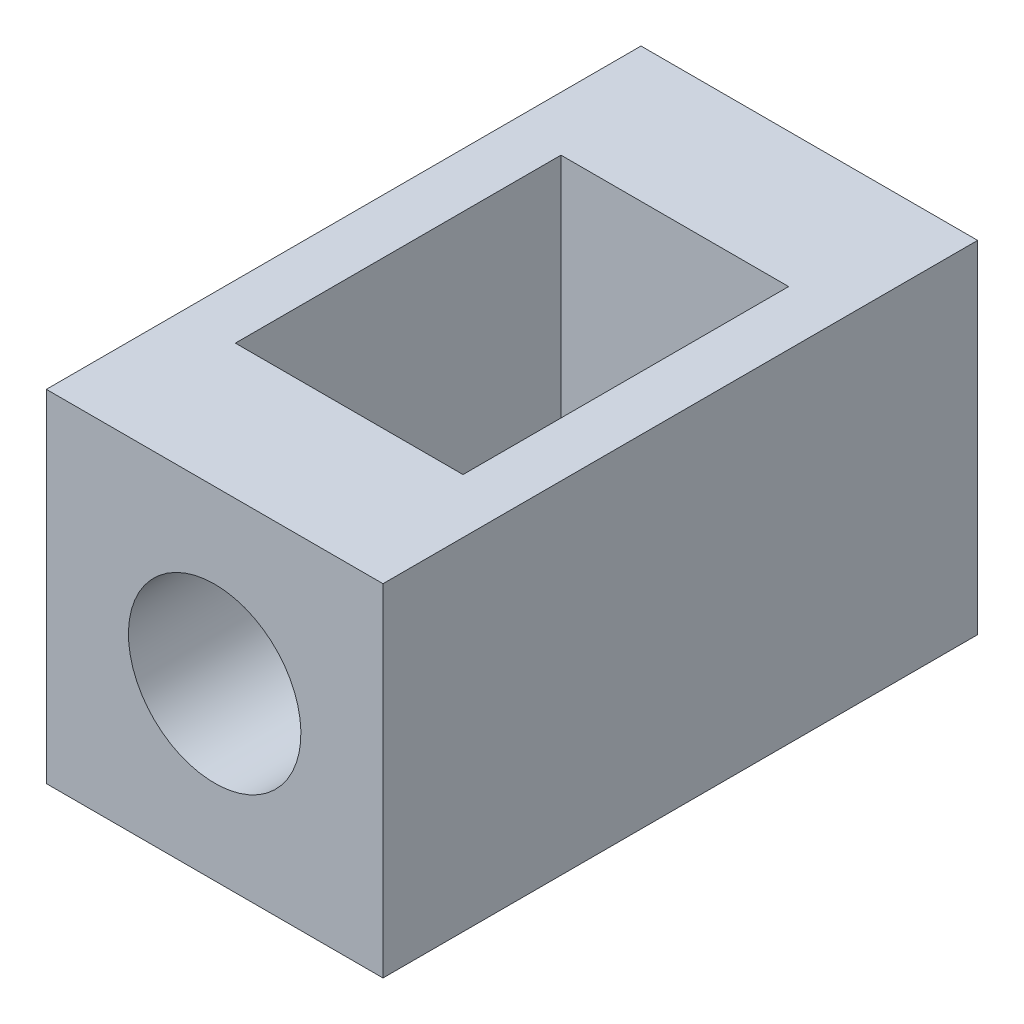
ISO-10303-21;
HEADER;
FILE_DESCRIPTION(('STEP AP214'),'2;1');
FILE_NAME('part.step','',(''),(''),'','','');
FILE_SCHEMA(('AUTOMOTIVE_DESIGN { 1 0 10303 214 1 1 1 1 }'));
ENDSEC;
DATA;
#1=APPLICATION_CONTEXT('core data for automotive mechanical design processes');
#2=APPLICATION_PROTOCOL_DEFINITION('international standard','automotive_design',2000,#1);
#3=PRODUCT_CONTEXT('',#1,'mechanical');
#4=PRODUCT('Part','Part','',(#3));
#5=PRODUCT_RELATED_PRODUCT_CATEGORY('part','',(#4));
#6=PRODUCT_DEFINITION_FORMATION('','',#4);
#7=PRODUCT_DEFINITION_CONTEXT('part definition',#1,'design');
#8=PRODUCT_DEFINITION('design','',#6,#7);
#9=PRODUCT_DEFINITION_SHAPE('','',#8);
#10=(LENGTH_UNIT() NAMED_UNIT(*) SI_UNIT(.MILLI.,.METRE.));
#11=(NAMED_UNIT(*) PLANE_ANGLE_UNIT() SI_UNIT($,.RADIAN.));
#12=(NAMED_UNIT(*) SI_UNIT($,.STERADIAN.) SOLID_ANGLE_UNIT());
#13=UNCERTAINTY_MEASURE_WITH_UNIT(LENGTH_MEASURE(1.E-05),#10,'distance_accuracy_value','');
#14=(GEOMETRIC_REPRESENTATION_CONTEXT(3) GLOBAL_UNCERTAINTY_ASSIGNED_CONTEXT((#13)) GLOBAL_UNIT_ASSIGNED_CONTEXT((#10,
#11,#12)) REPRESENTATION_CONTEXT('',''));
#15=CARTESIAN_POINT('',(0.,0.,0.));
#16=DIRECTION('',(0.,0.,1.));
#17=DIRECTION('',(1.,0.,0.));
#18=AXIS2_PLACEMENT_3D('',#15,#16,#17);
#19=CARTESIAN_POINT('',(7.63219809679219,-23.3190386158975,14.4950000000004));
#20=DIRECTION('',(0.,0.,1.));
#21=DIRECTION('',(3.01991605000675E-07,0.999999999999954,0.));
#22=AXIS2_PLACEMENT_3D('',#19,#20,#21);
#23=CYLINDRICAL_SURFACE('',#22,1.25);
#24=CARTESIAN_POINT('',(7.63219809679219,-23.3190386158968,12.5450000000004));
#25=DIRECTION('',(0.,0.,1.));
#26=DIRECTION('',(3.01991605000675E-07,0.999999999999954,0.));
#27=AXIS2_PLACEMENT_3D('',#24,#25,#26);
#28=CIRCLE('',#27,1.25);
#29=CARTESIAN_POINT('',(7.6321984742817,-22.0690386158968,12.5450000000004));
#30=VERTEX_POINT('',#29);
#31=EDGE_CURVE('E20',#30,#30,#28,.T.);
#32=ORIENTED_EDGE('',*,*,#31,.F.);
#33=EDGE_LOOP('',(#32));
#34=FACE_BOUND('',#33,.T.);
#35=CARTESIAN_POINT('',(7.63219809679219,-23.3190386158975,14.4950000000004));
#36=DIRECTION('',(0.,0.,1.));
#37=DIRECTION('',(3.01991605000675E-07,0.999999999999954,0.));
#38=AXIS2_PLACEMENT_3D('',#35,#36,#37);
#39=CIRCLE('',#38,1.25);
#40=CARTESIAN_POINT('',(7.6321984742817,-22.0690386158976,14.4950000000004));
#41=VERTEX_POINT('',#40);
#42=EDGE_CURVE('E11',#41,#41,#39,.T.);
#43=ORIENTED_EDGE('',*,*,#42,.T.);
#44=EDGE_LOOP('',(#43));
#45=FACE_BOUND('',#44,.T.);
#46=ADVANCED_FACE('F17',(#34,#45),#23,.F.);
#47=CARTESIAN_POINT('',(10.0721973493622,-25.7940393527564,14.4950000000005));
#48=DIRECTION('',(-0.999999999999954,3.01991605000676E-07,0.));
#49=DIRECTION('',(3.01991605000675E-07,0.999999999999954,0.));
#50=AXIS2_PLACEMENT_3D('',#47,#48,#49);
#51=PLANE('',#50);
#52=DIRECTION('',(0.,0.,1.));
#53=VECTOR('',#52,1.);
#54=CARTESIAN_POINT('',(10.0721988442212,-20.8440393527565,14.4950000000004));
#55=LINE('',#54,#53);
#56=CARTESIAN_POINT('',(10.0721988442212,-20.8440393527568,5.87500000000046));
#57=VERTEX_POINT('',#56);
#58=CARTESIAN_POINT('',(10.0721988442212,-20.8440393527565,14.4950000000004));
#59=VERTEX_POINT('',#58);
#60=EDGE_CURVE('E171',#57,#59,#55,.T.);
#61=ORIENTED_EDGE('',*,*,#60,.T.);
#62=DIRECTION('',(3.01991605000675E-07,0.999999999999954,0.));
#63=VECTOR('',#62,1.);
#64=CARTESIAN_POINT('',(10.0721973493622,-25.7940393527564,14.4950000000005));
#65=LINE('',#64,#63);
#66=CARTESIAN_POINT('',(10.0721973493622,-25.7940393527564,14.4950000000005));
#67=VERTEX_POINT('',#66);
#68=EDGE_CURVE('E27',#67,#59,#65,.T.);
#69=ORIENTED_EDGE('',*,*,#68,.F.);
#70=DIRECTION('',(0.,0.,1.));
#71=VECTOR('',#70,1.);
#72=CARTESIAN_POINT('',(10.0721973493622,-25.7940393527564,14.4950000000005));
#73=LINE('',#72,#71);
#74=CARTESIAN_POINT('',(10.0721973493622,-25.7940393527563,5.87500000000043));
#75=VERTEX_POINT('',#74);
#76=EDGE_CURVE('E224',#75,#67,#73,.T.);
#77=ORIENTED_EDGE('',*,*,#76,.F.);
#78=DIRECTION('',(3.01991605000675E-07,0.999999999999954,0.));
#79=VECTOR('',#78,1.);
#80=CARTESIAN_POINT('',(10.0721973493622,-25.7940393527563,5.87500000000043));
#81=LINE('',#80,#79);
#82=EDGE_CURVE('E73',#75,#57,#81,.T.);
#83=ORIENTED_EDGE('',*,*,#82,.T.);
#84=EDGE_LOOP('',(#61,#69,#77,#83));
#85=FACE_BOUND('',#84,.T.);
#86=ADVANCED_FACE('F282',(#85),#51,.F.);
#87=CARTESIAN_POINT('',(5.19219734936319,-25.7940378790374,14.4950000000004));
#88=DIRECTION('',(0.,0.,-1.));
#89=DIRECTION('',(0.999999999999954,-3.01991605000676E-07,0.));
#90=AXIS2_PLACEMENT_3D('',#87,#88,#89);
#91=PLANE('',#90);
#92=ORIENTED_EDGE('',*,*,#42,.F.);
#93=EDGE_LOOP('',(#92));
#94=FACE_BOUND('',#93,.T.);
#95=DIRECTION('',(-0.999999999999954,3.01991605000676E-07,0.));
#96=VECTOR('',#95,1.);
#97=CARTESIAN_POINT('',(5.19219884422117,-20.8440378790375,14.4950000000004));
#98=LINE('',#97,#96);
#99=CARTESIAN_POINT('',(5.19219884422117,-20.8440378790375,14.4950000000004));
#100=VERTEX_POINT('',#99);
#101=EDGE_CURVE('E208',#59,#100,#98,.T.);
#102=ORIENTED_EDGE('',*,*,#101,.T.);
#103=DIRECTION('',(3.01991605000675E-07,0.999999999999954,0.));
#104=VECTOR('',#103,1.);
#105=CARTESIAN_POINT('',(5.19219734936319,-25.7940378790374,14.4950000000004));
#106=LINE('',#105,#104);
#107=CARTESIAN_POINT('',(5.19219734936319,-25.7940378790374,14.4950000000004));
#108=VERTEX_POINT('',#107);
#109=EDGE_CURVE('E213',#108,#100,#106,.T.);
#110=ORIENTED_EDGE('',*,*,#109,.F.);
#111=DIRECTION('',(-0.999999999999954,3.01991605000676E-07,0.));
#112=VECTOR('',#111,1.);
#113=CARTESIAN_POINT('',(5.19219734936319,-25.7940378790374,14.4950000000004));
#114=LINE('',#113,#112);
#115=EDGE_CURVE('E219',#67,#108,#114,.T.);
#116=ORIENTED_EDGE('',*,*,#115,.F.);
#117=ORIENTED_EDGE('',*,*,#68,.T.);
#118=EDGE_LOOP('',(#102,#110,#116,#117));
#119=FACE_BOUND('',#118,.T.);
#120=ADVANCED_FACE('F285',(#94,#119),#91,.F.);
#121=CARTESIAN_POINT('',(5.19219734936319,-25.7940378790374,14.4950000000004));
#122=DIRECTION('',(0.999999999999954,-3.01991605000676E-07,0.));
#123=DIRECTION('',(-3.01991605000675E-07,-0.999999999999954,0.));
#124=AXIS2_PLACEMENT_3D('',#121,#122,#123);
#125=PLANE('',#124);
#126=DIRECTION('',(0.,0.,-1.));
#127=VECTOR('',#126,1.);
#128=CARTESIAN_POINT('',(5.19219884422117,-20.8440378790375,14.4950000000004));
#129=LINE('',#128,#127);
#130=CARTESIAN_POINT('',(5.19219884422117,-20.8440378790378,5.8750000000004));
#131=VERTEX_POINT('',#130);
#132=EDGE_CURVE('E196',#100,#131,#129,.T.);
#133=ORIENTED_EDGE('',*,*,#132,.T.);
#134=DIRECTION('',(3.01991605000675E-07,0.999999999999954,0.));
#135=VECTOR('',#134,1.);
#136=CARTESIAN_POINT('',(5.19219734936319,-25.7940378790372,5.87500000000037));
#137=LINE('',#136,#135);
#138=CARTESIAN_POINT('',(5.19219734936319,-25.7940378790372,5.87500000000037));
#139=VERTEX_POINT('',#138);
#140=EDGE_CURVE('E39',#139,#131,#137,.T.);
#141=ORIENTED_EDGE('',*,*,#140,.F.);
#142=DIRECTION('',(0.,0.,-1.));
#143=VECTOR('',#142,1.);
#144=CARTESIAN_POINT('',(5.19219734936319,-25.7940378790374,14.4950000000004));
#145=LINE('',#144,#143);
#146=EDGE_CURVE('E203',#108,#139,#145,.T.);
#147=ORIENTED_EDGE('',*,*,#146,.F.);
#148=ORIENTED_EDGE('',*,*,#109,.T.);
#149=EDGE_LOOP('',(#133,#141,#147,#148));
#150=FACE_BOUND('',#149,.T.);
#151=ADVANCED_FACE('F287',(#150),#125,.F.);
#152=CARTESIAN_POINT('',(5.19219734936319,-25.7940378790372,5.87500000000037));
#153=DIRECTION('',(0.,0.,1.));
#154=DIRECTION('',(-0.999999999999954,3.01991605000676E-07,0.));
#155=AXIS2_PLACEMENT_3D('',#152,#153,#154);
#156=PLANE('',#155);
#157=DIRECTION('',(0.999999999999954,-3.01991605000676E-07,0.));
#158=VECTOR('',#157,1.);
#159=CARTESIAN_POINT('',(5.19219884422117,-20.8440378790378,5.8750000000004));
#160=LINE('',#159,#158);
#161=EDGE_CURVE('E193',#131,#57,#160,.T.);
#162=ORIENTED_EDGE('',*,*,#161,.T.);
#163=ORIENTED_EDGE('',*,*,#82,.F.);
#164=DIRECTION('',(0.999999999999954,-3.01991605000676E-07,0.));
#165=VECTOR('',#164,1.);
#166=CARTESIAN_POINT('',(5.19219734936319,-25.7940378790372,5.87500000000037));
#167=LINE('',#166,#165);
#168=EDGE_CURVE('E199',#139,#75,#167,.T.);
#169=ORIENTED_EDGE('',*,*,#168,.F.);
#170=ORIENTED_EDGE('',*,*,#140,.T.);
#171=EDGE_LOOP('',(#162,#163,#169,#170));
#172=FACE_BOUND('',#171,.T.);
#173=ADVANCED_FACE('F303',(#172),#156,.F.);
#174=CARTESIAN_POINT('',(7.63219734936219,-25.7940386158968,10.1850000000004));
#175=DIRECTION('',(-3.01991605000675E-07,-0.999999999999954,0.));
#176=DIRECTION('',(-0.999999999999954,3.01991605000676E-07,0.));
#177=AXIS2_PLACEMENT_3D('',#174,#175,#176);
#178=PLANE('',#177);
#179=DIRECTION('',(0.,0.,1.));
#180=VECTOR('',#179,1.);
#181=CARTESIAN_POINT('',(9.2821973493622,-25.7940391141831,10.1850000000004));
#182=LINE('',#181,#180);
#183=CARTESIAN_POINT('',(9.2821973493622,-25.794039114183,7.82500000000042));
#184=VERTEX_POINT('',#183);
#185=CARTESIAN_POINT('',(9.2821973493622,-25.7940391141831,12.5450000000004));
#186=VERTEX_POINT('',#185);
#187=EDGE_CURVE('E166',#184,#186,#182,.T.);
#188=ORIENTED_EDGE('',*,*,#187,.F.);
#189=DIRECTION('',(0.999999999999954,-3.01991605000676E-07,0.));
#190=VECTOR('',#189,1.);
#191=CARTESIAN_POINT('',(7.63219734936319,-25.7940386158968,7.8250000000004));
#192=LINE('',#191,#190);
#193=CARTESIAN_POINT('',(5.98219734936317,-25.7940381176106,7.82500000000038));
#194=VERTEX_POINT('',#193);
#195=EDGE_CURVE('E127',#194,#184,#192,.T.);
#196=ORIENTED_EDGE('',*,*,#195,.F.);
#197=DIRECTION('',(0.,0.,-1.));
#198=VECTOR('',#197,1.);
#199=CARTESIAN_POINT('',(5.98219734936317,-25.7940381176108,10.1850000000004));
#200=LINE('',#199,#198);
#201=CARTESIAN_POINT('',(5.98219734936317,-25.7940381176108,12.5450000000004));
#202=VERTEX_POINT('',#201);
#203=EDGE_CURVE('E151',#202,#194,#200,.T.);
#204=ORIENTED_EDGE('',*,*,#203,.F.);
#205=DIRECTION('',(-0.999999999999954,3.01991605000676E-07,0.));
#206=VECTOR('',#205,1.);
#207=CARTESIAN_POINT('',(7.63219734936219,-25.7940386158968,12.5450000000004));
#208=LINE('',#207,#206);
#209=EDGE_CURVE('E140',#186,#202,#208,.T.);
#210=ORIENTED_EDGE('',*,*,#209,.F.);
#211=EDGE_LOOP('',(#188,#196,#204,#210));
#212=FACE_BOUND('',#211,.T.);
#213=ORIENTED_EDGE('',*,*,#76,.T.);
#214=ORIENTED_EDGE('',*,*,#115,.T.);
#215=ORIENTED_EDGE('',*,*,#146,.T.);
#216=ORIENTED_EDGE('',*,*,#168,.T.);
#217=EDGE_LOOP('',(#213,#214,#215,#216));
#218=FACE_BOUND('',#217,.T.);
#219=ADVANCED_FACE('F293',(#212,#218),#178,.T.);
#220=CARTESIAN_POINT('',(7.6321988442212,-20.8440386158967,10.1850000000004));
#221=DIRECTION('',(-3.01991605000675E-07,-0.999999999999954,0.));
#222=DIRECTION('',(-0.999999999999954,3.01991605000676E-07,0.));
#223=AXIS2_PLACEMENT_3D('',#220,#221,#222);
#224=PLANE('',#223);
#225=DIRECTION('',(0.999999999999954,-3.01991605000676E-07,0.));
#226=VECTOR('',#225,1.);
#227=CARTESIAN_POINT('',(5.98219884422119,-20.8440381176106,7.82500000000041));
#228=LINE('',#227,#226);
#229=CARTESIAN_POINT('',(5.98219884422119,-20.8440381176106,7.82500000000041));
#230=VERTEX_POINT('',#229);
#231=CARTESIAN_POINT('',(9.28219884422118,-20.8440391141835,7.82500000000045));
#232=VERTEX_POINT('',#231);
#233=EDGE_CURVE('E161',#230,#232,#228,.T.);
#234=ORIENTED_EDGE('',*,*,#233,.T.);
#235=DIRECTION('',(0.,0.,1.));
#236=VECTOR('',#235,1.);
#237=CARTESIAN_POINT('',(9.28219884422118,-20.8440391141837,12.5450000000004));
#238=LINE('',#237,#236);
#239=CARTESIAN_POINT('',(9.28219884422118,-20.8440391141837,12.5450000000004));
#240=VERTEX_POINT('',#239);
#241=EDGE_CURVE('E84',#232,#240,#238,.T.);
#242=ORIENTED_EDGE('',*,*,#241,.T.);
#243=DIRECTION('',(-0.999999999999954,3.01991605000676E-07,0.));
#244=VECTOR('',#243,1.);
#245=CARTESIAN_POINT('',(5.98219884422119,-20.8440381176107,12.5450000000004));
#246=LINE('',#245,#244);
#247=CARTESIAN_POINT('',(5.98219884422119,-20.8440381176107,12.5450000000004));
#248=VERTEX_POINT('',#247);
#249=EDGE_CURVE('E130',#240,#248,#246,.T.);
#250=ORIENTED_EDGE('',*,*,#249,.T.);
#251=DIRECTION('',(0.,0.,-1.));
#252=VECTOR('',#251,1.);
#253=CARTESIAN_POINT('',(5.98219884422119,-20.8440381176107,12.5450000000004));
#254=LINE('',#253,#252);
#255=EDGE_CURVE('E116',#248,#230,#254,.T.);
#256=ORIENTED_EDGE('',*,*,#255,.T.);
#257=EDGE_LOOP('',(#234,#242,#250,#256));
#258=FACE_BOUND('',#257,.T.);
#259=ORIENTED_EDGE('',*,*,#60,.F.);
#260=ORIENTED_EDGE('',*,*,#161,.F.);
#261=ORIENTED_EDGE('',*,*,#132,.F.);
#262=ORIENTED_EDGE('',*,*,#101,.F.);
#263=EDGE_LOOP('',(#259,#260,#261,#262));
#264=FACE_BOUND('',#263,.T.);
#265=ADVANCED_FACE('F131',(#258,#264),#224,.F.);
#266=CARTESIAN_POINT('',(9.28219884422118,-20.8440391141837,12.5450000000004));
#267=DIRECTION('',(0.999999999999954,-3.01991605000676E-07,0.));
#268=DIRECTION('',(-3.01991605000675E-07,-0.999999999999954,0.));
#269=AXIS2_PLACEMENT_3D('',#266,#267,#268);
#270=PLANE('',#269);
#271=ORIENTED_EDGE('',*,*,#187,.T.);
#272=DIRECTION('',(-3.01991605000675E-07,-0.999999999999954,0.));
#273=VECTOR('',#272,1.);
#274=CARTESIAN_POINT('',(9.28219884422118,-20.8440391141837,12.5450000000004));
#275=LINE('',#274,#273);
#276=EDGE_CURVE('E136',#240,#186,#275,.T.);
#277=ORIENTED_EDGE('',*,*,#276,.F.);
#278=ORIENTED_EDGE('',*,*,#241,.F.);
#279=DIRECTION('',(-3.01991605000675E-07,-0.999999999999954,0.));
#280=VECTOR('',#279,1.);
#281=CARTESIAN_POINT('',(9.28219884422118,-20.8440391141835,7.82500000000045));
#282=LINE('',#281,#280);
#283=EDGE_CURVE('E158',#232,#184,#282,.T.);
#284=ORIENTED_EDGE('',*,*,#283,.T.);
#285=EDGE_LOOP('',(#271,#277,#278,#284));
#286=FACE_BOUND('',#285,.T.);
#287=ADVANCED_FACE('F312',(#286),#270,.F.);
#288=CARTESIAN_POINT('',(5.98219884422119,-20.8440381176106,7.82500000000041));
#289=DIRECTION('',(0.,0.,-1.));
#290=DIRECTION('',(-3.01991605000675E-07,-0.999999999999954,0.));
#291=AXIS2_PLACEMENT_3D('',#288,#289,#290);
#292=PLANE('',#291);
#293=ORIENTED_EDGE('',*,*,#195,.T.);
#294=ORIENTED_EDGE('',*,*,#283,.F.);
#295=ORIENTED_EDGE('',*,*,#233,.F.);
#296=DIRECTION('',(-3.01991605000675E-07,-0.999999999999954,0.));
#297=VECTOR('',#296,1.);
#298=CARTESIAN_POINT('',(5.98219884422119,-20.8440381176106,7.82500000000041));
#299=LINE('',#298,#297);
#300=EDGE_CURVE('E124',#230,#194,#299,.T.);
#301=ORIENTED_EDGE('',*,*,#300,.T.);
#302=EDGE_LOOP('',(#293,#294,#295,#301));
#303=FACE_BOUND('',#302,.T.);
#304=ADVANCED_FACE('F315',(#303),#292,.F.);
#305=CARTESIAN_POINT('',(5.98219884422119,-20.8440381176107,12.5450000000004));
#306=DIRECTION('',(-0.999999999999954,3.01991605000676E-07,0.));
#307=DIRECTION('',(3.01991605000675E-07,0.999999999999954,0.));
#308=AXIS2_PLACEMENT_3D('',#305,#306,#307);
#309=PLANE('',#308);
#310=ORIENTED_EDGE('',*,*,#203,.T.);
#311=ORIENTED_EDGE('',*,*,#300,.F.);
#312=ORIENTED_EDGE('',*,*,#255,.F.);
#313=DIRECTION('',(-3.01991605000675E-07,-0.999999999999954,0.));
#314=VECTOR('',#313,1.);
#315=CARTESIAN_POINT('',(5.98219884422119,-20.8440381176107,12.5450000000004));
#316=LINE('',#315,#314);
#317=EDGE_CURVE('E121',#248,#202,#316,.T.);
#318=ORIENTED_EDGE('',*,*,#317,.T.);
#319=EDGE_LOOP('',(#310,#311,#312,#318));
#320=FACE_BOUND('',#319,.T.);
#321=ADVANCED_FACE('F119',(#320),#309,.F.);
#322=CARTESIAN_POINT('',(5.98219884422119,-20.8440381176107,12.5450000000004));
#323=DIRECTION('',(0.,0.,1.));
#324=DIRECTION('',(3.01991605000675E-07,0.999999999999954,0.));
#325=AXIS2_PLACEMENT_3D('',#322,#323,#324);
#326=PLANE('',#325);
#327=ORIENTED_EDGE('',*,*,#31,.T.);
#328=EDGE_LOOP('',(#327));
#329=FACE_BOUND('',#328,.T.);
#330=ORIENTED_EDGE('',*,*,#209,.T.);
#331=ORIENTED_EDGE('',*,*,#317,.F.);
#332=ORIENTED_EDGE('',*,*,#249,.F.);
#333=ORIENTED_EDGE('',*,*,#276,.T.);
#334=EDGE_LOOP('',(#330,#331,#332,#333));
#335=FACE_BOUND('',#334,.T.);
#336=ADVANCED_FACE('F138',(#329,#335),#326,.F.);
#337=CLOSED_SHELL('',(#46,#86,#120,#151,#173,#219,#265,#287,#304,#321,#336));
#338=MANIFOLD_SOLID_BREP('B1',#337);
#339=ADVANCED_BREP_SHAPE_REPRESENTATION('',(#18,#338),#14);
#340=SHAPE_DEFINITION_REPRESENTATION(#9,#339);
ENDSEC;
END-ISO-10303-21;
